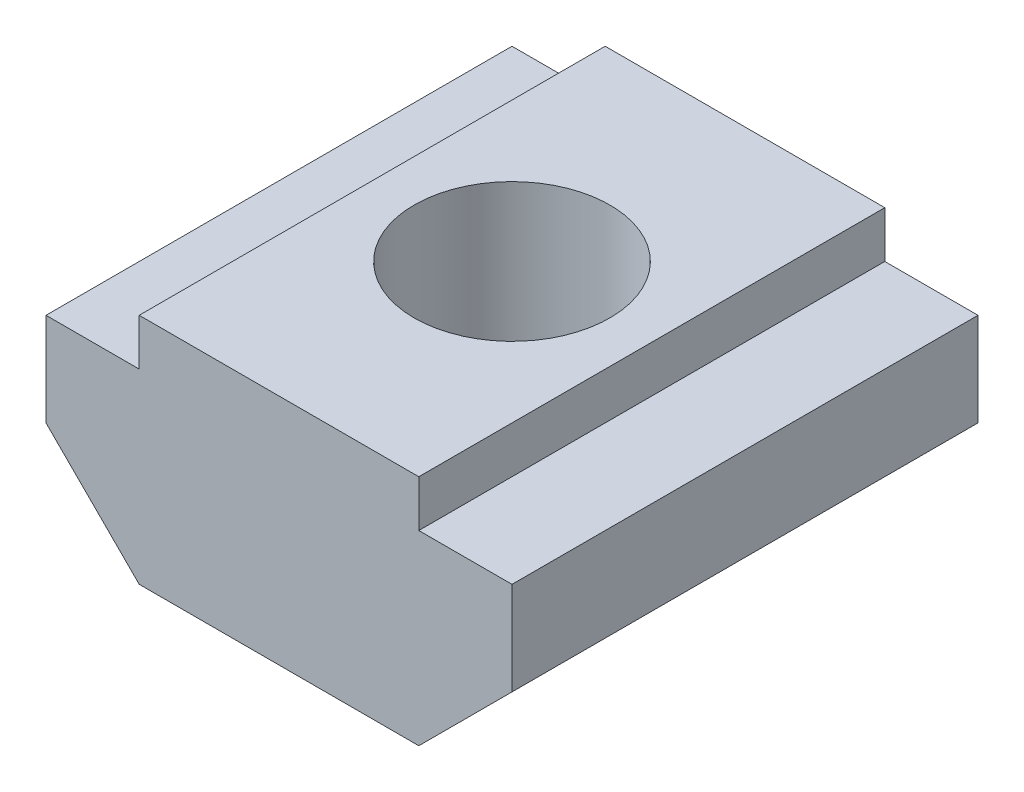
ISO-10303-21;
HEADER;
FILE_DESCRIPTION(('STEP AP214'),'2;1');
FILE_NAME('part.step','',(''),(''),'','','');
FILE_SCHEMA(('AUTOMOTIVE_DESIGN { 1 0 10303 214 1 1 1 1 }'));
ENDSEC;
DATA;
#1=APPLICATION_CONTEXT('core data for automotive mechanical design processes');
#2=APPLICATION_PROTOCOL_DEFINITION('international standard','automotive_design',2000,#1);
#3=PRODUCT_CONTEXT('',#1,'mechanical');
#4=PRODUCT('Part','Part','',(#3));
#5=PRODUCT_RELATED_PRODUCT_CATEGORY('part','',(#4));
#6=PRODUCT_DEFINITION_FORMATION('','',#4);
#7=PRODUCT_DEFINITION_CONTEXT('part definition',#1,'design');
#8=PRODUCT_DEFINITION('design','',#6,#7);
#9=PRODUCT_DEFINITION_SHAPE('','',#8);
#10=(LENGTH_UNIT() NAMED_UNIT(*) SI_UNIT(.MILLI.,.METRE.));
#11=(NAMED_UNIT(*) PLANE_ANGLE_UNIT() SI_UNIT($,.RADIAN.));
#12=(NAMED_UNIT(*) SI_UNIT($,.STERADIAN.) SOLID_ANGLE_UNIT());
#13=UNCERTAINTY_MEASURE_WITH_UNIT(LENGTH_MEASURE(1.E-05),#10,'distance_accuracy_value','');
#14=(GEOMETRIC_REPRESENTATION_CONTEXT(3) GLOBAL_UNCERTAINTY_ASSIGNED_CONTEXT((#13)) GLOBAL_UNIT_ASSIGNED_CONTEXT((#10,
#11,#12)) REPRESENTATION_CONTEXT('',''));
#15=CARTESIAN_POINT('',(0.,0.,0.));
#16=DIRECTION('',(0.,0.,1.));
#17=DIRECTION('',(1.,0.,0.));
#18=AXIS2_PLACEMENT_3D('',#15,#16,#17);
#19=CARTESIAN_POINT('',(0.,1.5,5.));
#20=DIRECTION('',(0.,1.,0.));
#21=DIRECTION('',(0.,0.,1.));
#22=AXIS2_PLACEMENT_3D('',#19,#20,#21);
#23=PLANE('',#22);
#24=DIRECTION('',(1.,0.,0.));
#25=VECTOR('',#24,1.);
#26=CARTESIAN_POINT('',(0.,1.5,-5.));
#27=LINE('',#26,#25);
#28=CARTESIAN_POINT('',(-5.,1.5,-5.));
#29=VERTEX_POINT('',#28);
#30=CARTESIAN_POINT('',(-3.,1.5,-5.));
#31=VERTEX_POINT('',#30);
#32=EDGE_CURVE('E154',#29,#31,#27,.T.);
#33=ORIENTED_EDGE('',*,*,#32,.F.);
#34=DIRECTION('',(0.,0.,-1.));
#35=VECTOR('',#34,1.);
#36=CARTESIAN_POINT('',(-5.,1.5,5.));
#37=LINE('',#36,#35);
#38=CARTESIAN_POINT('',(-5.,1.5,5.));
#39=VERTEX_POINT('',#38);
#40=EDGE_CURVE('E12',#39,#29,#37,.T.);
#41=ORIENTED_EDGE('',*,*,#40,.F.);
#42=DIRECTION('',(1.,0.,0.));
#43=VECTOR('',#42,1.);
#44=CARTESIAN_POINT('',(0.,1.5,5.));
#45=LINE('',#44,#43);
#46=CARTESIAN_POINT('',(-3.,1.5,5.));
#47=VERTEX_POINT('',#46);
#48=EDGE_CURVE('E180',#39,#47,#45,.T.);
#49=ORIENTED_EDGE('',*,*,#48,.T.);
#50=DIRECTION('',(0.,0.,-1.));
#51=VECTOR('',#50,1.);
#52=CARTESIAN_POINT('',(-3.,1.5,5.));
#53=LINE('',#52,#51);
#54=EDGE_CURVE('E66',#47,#31,#53,.T.);
#55=ORIENTED_EDGE('',*,*,#54,.T.);
#56=EDGE_LOOP('',(#33,#41,#49,#55));
#57=FACE_BOUND('',#56,.T.);
#58=ADVANCED_FACE('F50',(#57),#23,.T.);
#59=CARTESIAN_POINT('',(-5.,0.,5.));
#60=DIRECTION('',(-1.,0.,0.));
#61=DIRECTION('',(0.,0.,1.));
#62=AXIS2_PLACEMENT_3D('',#59,#60,#61);
#63=PLANE('',#62);
#64=DIRECTION('',(0.,1.,0.));
#65=VECTOR('',#64,1.);
#66=CARTESIAN_POINT('',(-5.,0.,-5.));
#67=LINE('',#66,#65);
#68=CARTESIAN_POINT('',(-5.,-0.50000000000002,-5.));
#69=VERTEX_POINT('',#68);
#70=EDGE_CURVE('E156',#69,#29,#67,.T.);
#71=ORIENTED_EDGE('',*,*,#70,.F.);
#72=DIRECTION('',(0.,0.,-1.));
#73=VECTOR('',#72,1.);
#74=CARTESIAN_POINT('',(-5.,-0.50000000000002,5.));
#75=LINE('',#74,#73);
#76=CARTESIAN_POINT('',(-5.,-0.50000000000002,5.));
#77=VERTEX_POINT('',#76);
#78=EDGE_CURVE('E58',#77,#69,#75,.T.);
#79=ORIENTED_EDGE('',*,*,#78,.F.);
#80=DIRECTION('',(0.,1.,0.));
#81=VECTOR('',#80,1.);
#82=CARTESIAN_POINT('',(-5.,0.,5.));
#83=LINE('',#82,#81);
#84=EDGE_CURVE('E206',#77,#39,#83,.T.);
#85=ORIENTED_EDGE('',*,*,#84,.T.);
#86=ORIENTED_EDGE('',*,*,#40,.T.);
#87=EDGE_LOOP('',(#71,#79,#85,#86));
#88=FACE_BOUND('',#87,.T.);
#89=ADVANCED_FACE('F205',(#88),#63,.T.);
#90=CARTESIAN_POINT('',(-2.74999999999998,-2.75000000000001,5.));
#91=DIRECTION('',(0.707106781186544,0.707106781186551,0.));
#92=DIRECTION('',(-0.707106781186551,0.707106781186544,0.));
#93=AXIS2_PLACEMENT_3D('',#90,#91,#92);
#94=PLANE('',#93);
#95=DIRECTION('',(0.707106781186551,-0.707106781186544,0.));
#96=VECTOR('',#95,1.);
#97=CARTESIAN_POINT('',(-2.74999999999998,-2.75000000000001,-5.));
#98=LINE('',#97,#96);
#99=CARTESIAN_POINT('',(-3.,-2.5,-5.));
#100=VERTEX_POINT('',#99);
#101=EDGE_CURVE('E160',#69,#100,#98,.T.);
#102=ORIENTED_EDGE('',*,*,#101,.T.);
#103=DIRECTION('',(0.,0.,-1.));
#104=VECTOR('',#103,1.);
#105=CARTESIAN_POINT('',(-3.,-2.5,5.));
#106=LINE('',#105,#104);
#107=CARTESIAN_POINT('',(-3.,-2.5,5.));
#108=VERTEX_POINT('',#107);
#109=EDGE_CURVE('E190',#108,#100,#106,.T.);
#110=ORIENTED_EDGE('',*,*,#109,.F.);
#111=DIRECTION('',(0.707106781186551,-0.707106781186544,0.));
#112=VECTOR('',#111,1.);
#113=CARTESIAN_POINT('',(-2.74999999999998,-2.75000000000001,5.));
#114=LINE('',#113,#112);
#115=EDGE_CURVE('E197',#77,#108,#114,.T.);
#116=ORIENTED_EDGE('',*,*,#115,.F.);
#117=ORIENTED_EDGE('',*,*,#78,.T.);
#118=EDGE_LOOP('',(#102,#110,#116,#117));
#119=FACE_BOUND('',#118,.T.);
#120=ADVANCED_FACE('F195',(#119),#94,.F.);
#121=CARTESIAN_POINT('',(0.,-2.5,5.));
#122=DIRECTION('',(0.,1.,0.));
#123=DIRECTION('',(0.,0.,1.));
#124=AXIS2_PLACEMENT_3D('',#121,#122,#123);
#125=PLANE('',#124);
#126=CARTESIAN_POINT('',(0.,-2.5,0.));
#127=DIRECTION('',(0.,1.,0.));
#128=DIRECTION('',(0.,0.,1.));
#129=AXIS2_PLACEMENT_3D('',#126,#127,#128);
#130=CIRCLE('',#129,2.1);
#131=CARTESIAN_POINT('',(0.,-2.5,2.1));
#132=VERTEX_POINT('',#131);
#133=EDGE_CURVE('E157',#132,#132,#130,.T.);
#134=ORIENTED_EDGE('',*,*,#133,.T.);
#135=EDGE_LOOP('',(#134));
#136=FACE_BOUND('',#135,.T.);
#137=DIRECTION('',(1.,0.,0.));
#138=VECTOR('',#137,1.);
#139=CARTESIAN_POINT('',(0.,-2.5,-5.));
#140=LINE('',#139,#138);
#141=CARTESIAN_POINT('',(3.,-2.5,-5.));
#142=VERTEX_POINT('',#141);
#143=EDGE_CURVE('E162',#100,#142,#140,.T.);
#144=ORIENTED_EDGE('',*,*,#143,.T.);
#145=DIRECTION('',(0.,0.,-1.));
#146=VECTOR('',#145,1.);
#147=CARTESIAN_POINT('',(3.,-2.5,5.));
#148=LINE('',#147,#146);
#149=CARTESIAN_POINT('',(3.,-2.5,5.));
#150=VERTEX_POINT('',#149);
#151=EDGE_CURVE('E188',#150,#142,#148,.T.);
#152=ORIENTED_EDGE('',*,*,#151,.F.);
#153=DIRECTION('',(1.,0.,0.));
#154=VECTOR('',#153,1.);
#155=CARTESIAN_POINT('',(0.,-2.5,5.));
#156=LINE('',#155,#154);
#157=EDGE_CURVE('E384',#108,#150,#156,.T.);
#158=ORIENTED_EDGE('',*,*,#157,.F.);
#159=ORIENTED_EDGE('',*,*,#109,.T.);
#160=EDGE_LOOP('',(#144,#152,#158,#159));
#161=FACE_BOUND('',#160,.T.);
#162=ADVANCED_FACE('F225',(#136,#161),#125,.F.);
#163=CARTESIAN_POINT('',(2.74999999999998,-2.75000000000001,5.));
#164=DIRECTION('',(0.707106781186544,-0.707106781186551,0.));
#165=DIRECTION('',(0.707106781186551,0.707106781186544,0.));
#166=AXIS2_PLACEMENT_3D('',#163,#164,#165);
#167=PLANE('',#166);
#168=DIRECTION('',(-0.707106781186551,-0.707106781186544,0.));
#169=VECTOR('',#168,1.);
#170=CARTESIAN_POINT('',(2.74999999999998,-2.75000000000001,-5.));
#171=LINE('',#170,#169);
#172=CARTESIAN_POINT('',(5.,-0.500000000000019,-5.));
#173=VERTEX_POINT('',#172);
#174=EDGE_CURVE('E165',#173,#142,#171,.T.);
#175=ORIENTED_EDGE('',*,*,#174,.F.);
#176=DIRECTION('',(0.,0.,-1.));
#177=VECTOR('',#176,1.);
#178=CARTESIAN_POINT('',(5.,-0.500000000000019,5.));
#179=LINE('',#178,#177);
#180=CARTESIAN_POINT('',(5.,-0.500000000000019,5.));
#181=VERTEX_POINT('',#180);
#182=EDGE_CURVE('E186',#181,#173,#179,.T.);
#183=ORIENTED_EDGE('',*,*,#182,.F.);
#184=DIRECTION('',(-0.707106781186551,-0.707106781186544,0.));
#185=VECTOR('',#184,1.);
#186=CARTESIAN_POINT('',(2.74999999999998,-2.75000000000001,5.));
#187=LINE('',#186,#185);
#188=EDGE_CURVE('E386',#181,#150,#187,.T.);
#189=ORIENTED_EDGE('',*,*,#188,.T.);
#190=ORIENTED_EDGE('',*,*,#151,.T.);
#191=EDGE_LOOP('',(#175,#183,#189,#190));
#192=FACE_BOUND('',#191,.T.);
#193=ADVANCED_FACE('F230',(#192),#167,.T.);
#194=CARTESIAN_POINT('',(5.,0.,5.));
#195=DIRECTION('',(-1.,0.,0.));
#196=DIRECTION('',(0.,0.,1.));
#197=AXIS2_PLACEMENT_3D('',#194,#195,#196);
#198=PLANE('',#197);
#199=DIRECTION('',(0.,1.,0.));
#200=VECTOR('',#199,1.);
#201=CARTESIAN_POINT('',(5.,0.,-5.));
#202=LINE('',#201,#200);
#203=CARTESIAN_POINT('',(5.,1.5,-5.));
#204=VERTEX_POINT('',#203);
#205=EDGE_CURVE('E168',#173,#204,#202,.T.);
#206=ORIENTED_EDGE('',*,*,#205,.T.);
#207=DIRECTION('',(0.,0.,-1.));
#208=VECTOR('',#207,1.);
#209=CARTESIAN_POINT('',(5.,1.5,5.));
#210=LINE('',#209,#208);
#211=CARTESIAN_POINT('',(5.,1.5,5.));
#212=VERTEX_POINT('',#211);
#213=EDGE_CURVE('E184',#212,#204,#210,.T.);
#214=ORIENTED_EDGE('',*,*,#213,.F.);
#215=DIRECTION('',(0.,1.,0.));
#216=VECTOR('',#215,1.);
#217=CARTESIAN_POINT('',(5.,0.,5.));
#218=LINE('',#217,#216);
#219=EDGE_CURVE('E389',#181,#212,#218,.T.);
#220=ORIENTED_EDGE('',*,*,#219,.F.);
#221=ORIENTED_EDGE('',*,*,#182,.T.);
#222=EDGE_LOOP('',(#206,#214,#220,#221));
#223=FACE_BOUND('',#222,.T.);
#224=ADVANCED_FACE('F234',(#223),#198,.F.);
#225=CARTESIAN_POINT('',(0.,1.5,5.));
#226=DIRECTION('',(0.,1.,0.));
#227=DIRECTION('',(0.,0.,1.));
#228=AXIS2_PLACEMENT_3D('',#225,#226,#227);
#229=PLANE('',#228);
#230=DIRECTION('',(1.,0.,0.));
#231=VECTOR('',#230,1.);
#232=CARTESIAN_POINT('',(0.,1.5,-5.));
#233=LINE('',#232,#231);
#234=CARTESIAN_POINT('',(3.,1.5,-5.));
#235=VERTEX_POINT('',#234);
#236=EDGE_CURVE('E171',#235,#204,#233,.T.);
#237=ORIENTED_EDGE('',*,*,#236,.F.);
#238=DIRECTION('',(0.,0.,-1.));
#239=VECTOR('',#238,1.);
#240=CARTESIAN_POINT('',(3.,1.5,5.));
#241=LINE('',#240,#239);
#242=CARTESIAN_POINT('',(3.,1.5,5.));
#243=VERTEX_POINT('',#242);
#244=EDGE_CURVE('E146',#243,#235,#241,.T.);
#245=ORIENTED_EDGE('',*,*,#244,.F.);
#246=DIRECTION('',(1.,0.,0.));
#247=VECTOR('',#246,1.);
#248=CARTESIAN_POINT('',(0.,1.5,5.));
#249=LINE('',#248,#247);
#250=EDGE_CURVE('E136',#243,#212,#249,.T.);
#251=ORIENTED_EDGE('',*,*,#250,.T.);
#252=ORIENTED_EDGE('',*,*,#213,.T.);
#253=EDGE_LOOP('',(#237,#245,#251,#252));
#254=FACE_BOUND('',#253,.T.);
#255=ADVANCED_FACE('F238',(#254),#229,.T.);
#256=CARTESIAN_POINT('',(3.,0.,5.));
#257=DIRECTION('',(-1.,0.,0.));
#258=DIRECTION('',(0.,0.,1.));
#259=AXIS2_PLACEMENT_3D('',#256,#257,#258);
#260=PLANE('',#259);
#261=DIRECTION('',(0.,1.,0.));
#262=VECTOR('',#261,1.);
#263=CARTESIAN_POINT('',(3.,0.,-5.));
#264=LINE('',#263,#262);
#265=CARTESIAN_POINT('',(3.,2.5,-5.));
#266=VERTEX_POINT('',#265);
#267=EDGE_CURVE('E143',#235,#266,#264,.T.);
#268=ORIENTED_EDGE('',*,*,#267,.T.);
#269=DIRECTION('',(0.,0.,-1.));
#270=VECTOR('',#269,1.);
#271=CARTESIAN_POINT('',(3.,2.5,5.));
#272=LINE('',#271,#270);
#273=CARTESIAN_POINT('',(3.,2.5,5.));
#274=VERTEX_POINT('',#273);
#275=EDGE_CURVE('E140',#274,#266,#272,.T.);
#276=ORIENTED_EDGE('',*,*,#275,.F.);
#277=DIRECTION('',(0.,1.,0.));
#278=VECTOR('',#277,1.);
#279=CARTESIAN_POINT('',(3.,0.,5.));
#280=LINE('',#279,#278);
#281=EDGE_CURVE('E129',#243,#274,#280,.T.);
#282=ORIENTED_EDGE('',*,*,#281,.F.);
#283=ORIENTED_EDGE('',*,*,#244,.T.);
#284=EDGE_LOOP('',(#268,#276,#282,#283));
#285=FACE_BOUND('',#284,.T.);
#286=ADVANCED_FACE('F141',(#285),#260,.F.);
#287=CARTESIAN_POINT('',(0.,2.5,5.));
#288=DIRECTION('',(0.,1.,0.));
#289=DIRECTION('',(0.,0.,1.));
#290=AXIS2_PLACEMENT_3D('',#287,#288,#289);
#291=PLANE('',#290);
#292=CARTESIAN_POINT('',(0.,2.5,0.));
#293=DIRECTION('',(0.,1.,0.));
#294=DIRECTION('',(0.,0.,1.));
#295=AXIS2_PLACEMENT_3D('',#292,#293,#294);
#296=CIRCLE('',#295,2.1);
#297=CARTESIAN_POINT('',(0.,2.5,2.1));
#298=VERTEX_POINT('',#297);
#299=EDGE_CURVE('E374',#298,#298,#296,.T.);
#300=ORIENTED_EDGE('',*,*,#299,.F.);
#301=EDGE_LOOP('',(#300));
#302=FACE_BOUND('',#301,.T.);
#303=DIRECTION('',(1.,0.,0.));
#304=VECTOR('',#303,1.);
#305=CARTESIAN_POINT('',(0.,2.5,-5.));
#306=LINE('',#305,#304);
#307=CARTESIAN_POINT('',(-3.,2.5,-5.));
#308=VERTEX_POINT('',#307);
#309=EDGE_CURVE('E175',#308,#266,#306,.T.);
#310=ORIENTED_EDGE('',*,*,#309,.F.);
#311=DIRECTION('',(0.,0.,-1.));
#312=VECTOR('',#311,1.);
#313=CARTESIAN_POINT('',(-3.,2.5,5.));
#314=LINE('',#313,#312);
#315=CARTESIAN_POINT('',(-3.,2.5,5.));
#316=VERTEX_POINT('',#315);
#317=EDGE_CURVE('E97',#316,#308,#314,.T.);
#318=ORIENTED_EDGE('',*,*,#317,.F.);
#319=DIRECTION('',(1.,0.,0.));
#320=VECTOR('',#319,1.);
#321=CARTESIAN_POINT('',(0.,2.5,5.));
#322=LINE('',#321,#320);
#323=EDGE_CURVE('E134',#316,#274,#322,.T.);
#324=ORIENTED_EDGE('',*,*,#323,.T.);
#325=ORIENTED_EDGE('',*,*,#275,.T.);
#326=EDGE_LOOP('',(#310,#318,#324,#325));
#327=FACE_BOUND('',#326,.T.);
#328=ADVANCED_FACE('F148',(#302,#327),#291,.T.);
#329=CARTESIAN_POINT('',(-3.,0.,5.));
#330=DIRECTION('',(-1.,0.,0.));
#331=DIRECTION('',(0.,0.,1.));
#332=AXIS2_PLACEMENT_3D('',#329,#330,#331);
#333=PLANE('',#332);
#334=DIRECTION('',(0.,1.,0.));
#335=VECTOR('',#334,1.);
#336=CARTESIAN_POINT('',(-3.,0.,-5.));
#337=LINE('',#336,#335);
#338=EDGE_CURVE('E177',#31,#308,#337,.T.);
#339=ORIENTED_EDGE('',*,*,#338,.F.);
#340=ORIENTED_EDGE('',*,*,#54,.F.);
#341=DIRECTION('',(0.,1.,0.));
#342=VECTOR('',#341,1.);
#343=CARTESIAN_POINT('',(-3.,0.,5.));
#344=LINE('',#343,#342);
#345=EDGE_CURVE('E149',#47,#316,#344,.T.);
#346=ORIENTED_EDGE('',*,*,#345,.T.);
#347=ORIENTED_EDGE('',*,*,#317,.T.);
#348=EDGE_LOOP('',(#339,#340,#346,#347));
#349=FACE_BOUND('',#348,.T.);
#350=ADVANCED_FACE('F207',(#349),#333,.T.);
#351=CARTESIAN_POINT('',(0.,0.,5.));
#352=DIRECTION('',(0.,0.,1.));
#353=DIRECTION('',(1.,0.,0.));
#354=AXIS2_PLACEMENT_3D('',#351,#352,#353);
#355=PLANE('',#354);
#356=ORIENTED_EDGE('',*,*,#48,.F.);
#357=ORIENTED_EDGE('',*,*,#84,.F.);
#358=ORIENTED_EDGE('',*,*,#115,.T.);
#359=ORIENTED_EDGE('',*,*,#157,.T.);
#360=ORIENTED_EDGE('',*,*,#188,.F.);
#361=ORIENTED_EDGE('',*,*,#219,.T.);
#362=ORIENTED_EDGE('',*,*,#250,.F.);
#363=ORIENTED_EDGE('',*,*,#281,.T.);
#364=ORIENTED_EDGE('',*,*,#323,.F.);
#365=ORIENTED_EDGE('',*,*,#345,.F.);
#366=EDGE_LOOP('',(#356,#357,#358,#359,#360,#361,#362,#363,#364,#365));
#367=FACE_BOUND('',#366,.T.);
#368=ADVANCED_FACE('F131',(#367),#355,.T.);
#369=CARTESIAN_POINT('',(0.,0.,-5.));
#370=DIRECTION('',(0.,0.,1.));
#371=DIRECTION('',(1.,0.,0.));
#372=AXIS2_PLACEMENT_3D('',#369,#370,#371);
#373=PLANE('',#372);
#374=ORIENTED_EDGE('',*,*,#32,.T.);
#375=ORIENTED_EDGE('',*,*,#338,.T.);
#376=ORIENTED_EDGE('',*,*,#309,.T.);
#377=ORIENTED_EDGE('',*,*,#267,.F.);
#378=ORIENTED_EDGE('',*,*,#236,.T.);
#379=ORIENTED_EDGE('',*,*,#205,.F.);
#380=ORIENTED_EDGE('',*,*,#174,.T.);
#381=ORIENTED_EDGE('',*,*,#143,.F.);
#382=ORIENTED_EDGE('',*,*,#101,.F.);
#383=ORIENTED_EDGE('',*,*,#70,.T.);
#384=EDGE_LOOP('',(#374,#375,#376,#377,#378,#379,#380,#381,#382,#383));
#385=FACE_BOUND('',#384,.T.);
#386=ADVANCED_FACE('F204',(#385),#373,.F.);
#387=CARTESIAN_POINT('',(0.,-2.5,0.));
#388=DIRECTION('',(0.,1.,0.));
#389=DIRECTION('',(0.,0.,1.));
#390=AXIS2_PLACEMENT_3D('',#387,#388,#389);
#391=CYLINDRICAL_SURFACE('',#390,2.1);
#392=ORIENTED_EDGE('',*,*,#133,.F.);
#393=EDGE_LOOP('',(#392));
#394=FACE_BOUND('',#393,.T.);
#395=ORIENTED_EDGE('',*,*,#299,.T.);
#396=EDGE_LOOP('',(#395));
#397=FACE_BOUND('',#396,.T.);
#398=ADVANCED_FACE('F263',(#394,#397),#391,.F.);
#399=CLOSED_SHELL('',(#58,#89,#120,#162,#193,#224,#255,#286,#328,#350,#368,#386,#398));
#400=MANIFOLD_SOLID_BREP('B2',#399);
#401=ADVANCED_BREP_SHAPE_REPRESENTATION('',(#18,#400),#14);
#402=SHAPE_DEFINITION_REPRESENTATION(#9,#401);
ENDSEC;
END-ISO-10303-21;
